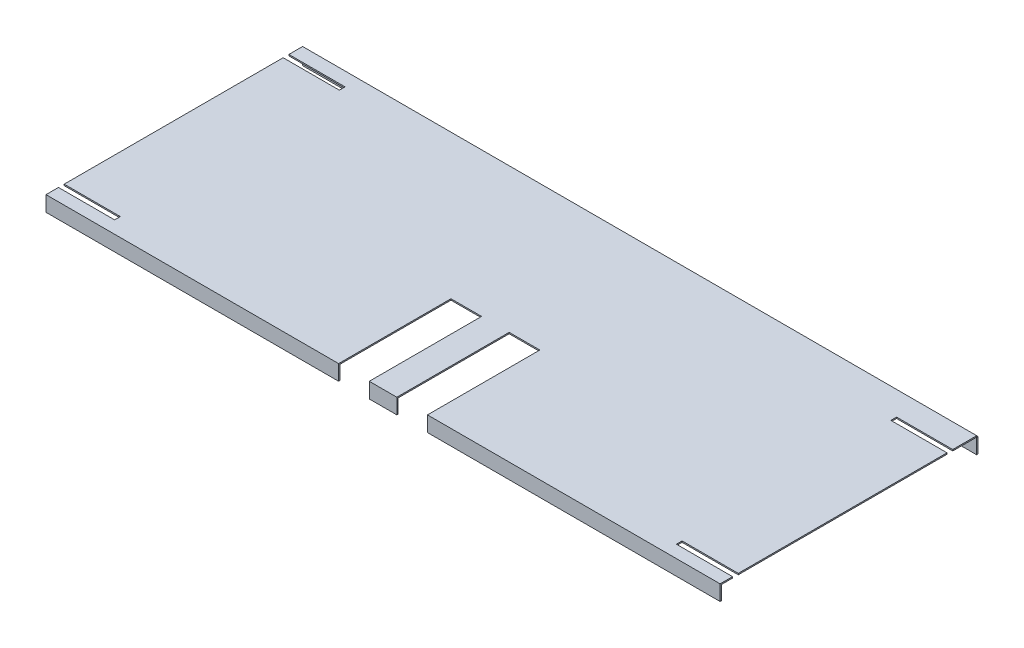
ISO-10303-21;
HEADER;
FILE_DESCRIPTION(('STEP AP214'),'2;1');
FILE_NAME('part.step','',(''),(''),'','','');
FILE_SCHEMA(('AUTOMOTIVE_DESIGN { 1 0 10303 214 1 1 1 1 }'));
ENDSEC;
DATA;
#1=APPLICATION_CONTEXT('core data for automotive mechanical design processes');
#2=APPLICATION_PROTOCOL_DEFINITION('international standard','automotive_design',2000,#1);
#3=PRODUCT_CONTEXT('',#1,'mechanical');
#4=PRODUCT('Part','Part','',(#3));
#5=PRODUCT_RELATED_PRODUCT_CATEGORY('part','',(#4));
#6=PRODUCT_DEFINITION_FORMATION('','',#4);
#7=PRODUCT_DEFINITION_CONTEXT('part definition',#1,'design');
#8=PRODUCT_DEFINITION('design','',#6,#7);
#9=PRODUCT_DEFINITION_SHAPE('','',#8);
#10=(LENGTH_UNIT() NAMED_UNIT(*) SI_UNIT(.MILLI.,.METRE.));
#11=(NAMED_UNIT(*) PLANE_ANGLE_UNIT() SI_UNIT($,.RADIAN.));
#12=(NAMED_UNIT(*) SI_UNIT($,.STERADIAN.) SOLID_ANGLE_UNIT());
#13=UNCERTAINTY_MEASURE_WITH_UNIT(LENGTH_MEASURE(1.E-05),#10,'distance_accuracy_value','');
#14=(GEOMETRIC_REPRESENTATION_CONTEXT(3) GLOBAL_UNCERTAINTY_ASSIGNED_CONTEXT((#13)) GLOBAL_UNIT_ASSIGNED_CONTEXT((#10,
#11,#12)) REPRESENTATION_CONTEXT('',''));
#15=CARTESIAN_POINT('',(0.,0.,0.));
#16=DIRECTION('',(0.,0.,1.));
#17=DIRECTION('',(1.,0.,0.));
#18=AXIS2_PLACEMENT_3D('',#15,#16,#17);
#19=CARTESIAN_POINT('',(0.,0.,-1.6002));
#20=DIRECTION('',(1.,0.,0.));
#21=DIRECTION('',(0.,1.,0.));
#22=AXIS2_PLACEMENT_3D('',#19,#20,#21);
#23=PLANE('',#22);
#24=DIRECTION('',(0.,1.,0.));
#25=VECTOR('',#24,1.);
#26=CARTESIAN_POINT('',(0.,0.,0.));
#27=LINE('',#26,#25);
#28=CARTESIAN_POINT('',(0.,-19.05,0.));
#29=VERTEX_POINT('',#28);
#30=CARTESIAN_POINT('',(0.,0.,0.));
#31=VERTEX_POINT('',#30);
#32=EDGE_CURVE('E109',#29,#31,#27,.T.);
#33=ORIENTED_EDGE('',*,*,#32,.T.);
#34=DIRECTION('',(0.,0.,1.));
#35=VECTOR('',#34,1.);
#36=CARTESIAN_POINT('',(0.,0.,-1.6002));
#37=LINE('',#36,#35);
#38=CARTESIAN_POINT('',(0.,0.,-1.6002));
#39=VERTEX_POINT('',#38);
#40=EDGE_CURVE('E12',#39,#31,#37,.T.);
#41=ORIENTED_EDGE('',*,*,#40,.F.);
#42=DIRECTION('',(0.,1.,0.));
#43=VECTOR('',#42,1.);
#44=CARTESIAN_POINT('',(0.,0.,-1.6002));
#45=LINE('',#44,#43);
#46=CARTESIAN_POINT('',(0.,-19.05,-1.6002));
#47=VERTEX_POINT('',#46);
#48=EDGE_CURVE('E97',#47,#39,#45,.T.);
#49=ORIENTED_EDGE('',*,*,#48,.F.);
#50=DIRECTION('',(0.,0.,1.));
#51=VECTOR('',#50,1.);
#52=CARTESIAN_POINT('',(0.,-19.05,-1.6002));
#53=LINE('',#52,#51);
#54=EDGE_CURVE('E105',#47,#29,#53,.T.);
#55=ORIENTED_EDGE('',*,*,#54,.T.);
#56=EDGE_LOOP('',(#33,#41,#49,#55));
#57=FACE_BOUND('',#56,.T.);
#58=ADVANCED_FACE('F46',(#57),#23,.F.);
#59=CARTESIAN_POINT('',(0.,0.,-1.6002));
#60=DIRECTION('',(0.,-1.,0.));
#61=DIRECTION('',(0.,0.,-1.));
#62=AXIS2_PLACEMENT_3D('',#59,#60,#61);
#63=PLANE('',#62);
#64=DIRECTION('',(1.,0.,0.));
#65=VECTOR('',#64,1.);
#66=CARTESIAN_POINT('',(0.,0.,0.));
#67=LINE('',#66,#65);
#68=CARTESIAN_POINT('',(838.2,0.,0.));
#69=VERTEX_POINT('',#68);
#70=EDGE_CURVE('E101',#31,#69,#67,.T.);
#71=ORIENTED_EDGE('',*,*,#70,.T.);
#72=DIRECTION('',(0.,0.,1.));
#73=VECTOR('',#72,1.);
#74=CARTESIAN_POINT('',(838.2,0.,-1.6002));
#75=LINE('',#74,#73);
#76=CARTESIAN_POINT('',(838.2,0.,-1.6002));
#77=VERTEX_POINT('',#76);
#78=EDGE_CURVE('E54',#77,#69,#75,.T.);
#79=ORIENTED_EDGE('',*,*,#78,.F.);
#80=DIRECTION('',(1.,0.,0.));
#81=VECTOR('',#80,1.);
#82=CARTESIAN_POINT('',(0.,0.,-1.6002));
#83=LINE('',#82,#81);
#84=EDGE_CURVE('E92',#39,#77,#83,.T.);
#85=ORIENTED_EDGE('',*,*,#84,.F.);
#86=ORIENTED_EDGE('',*,*,#40,.T.);
#87=EDGE_LOOP('',(#71,#79,#85,#86));
#88=FACE_BOUND('',#87,.T.);
#89=ADVANCED_FACE('F100',(#88),#63,.F.);
#90=CARTESIAN_POINT('',(838.2,0.,-1.6002));
#91=DIRECTION('',(-1.,0.,0.));
#92=DIRECTION('',(0.,0.,1.));
#93=AXIS2_PLACEMENT_3D('',#90,#91,#92);
#94=PLANE('',#93);
#95=DIRECTION('',(0.,-1.,0.));
#96=VECTOR('',#95,1.);
#97=CARTESIAN_POINT('',(838.2,0.,0.));
#98=LINE('',#97,#96);
#99=CARTESIAN_POINT('',(838.2,-19.0500000000001,0.));
#100=VERTEX_POINT('',#99);
#101=EDGE_CURVE('E79',#69,#100,#98,.T.);
#102=ORIENTED_EDGE('',*,*,#101,.T.);
#103=DIRECTION('',(0.,0.,1.));
#104=VECTOR('',#103,1.);
#105=CARTESIAN_POINT('',(838.2,-19.0500000000001,-1.6002));
#106=LINE('',#105,#104);
#107=CARTESIAN_POINT('',(838.2,-19.0500000000001,-1.6002));
#108=VERTEX_POINT('',#107);
#109=EDGE_CURVE('E102',#108,#100,#106,.T.);
#110=ORIENTED_EDGE('',*,*,#109,.F.);
#111=DIRECTION('',(0.,-1.,0.));
#112=VECTOR('',#111,1.);
#113=CARTESIAN_POINT('',(838.2,0.,-1.6002));
#114=LINE('',#113,#112);
#115=EDGE_CURVE('E95',#77,#108,#114,.T.);
#116=ORIENTED_EDGE('',*,*,#115,.F.);
#117=ORIENTED_EDGE('',*,*,#78,.T.);
#118=EDGE_LOOP('',(#102,#110,#116,#117));
#119=FACE_BOUND('',#118,.T.);
#120=ADVANCED_FACE('F103',(#119),#94,.F.);
#121=CARTESIAN_POINT('',(0.,-19.05,-1.6002));
#122=DIRECTION('',(0.,1.,0.));
#123=DIRECTION('',(-1.,0.,0.));
#124=AXIS2_PLACEMENT_3D('',#121,#122,#123);
#125=PLANE('',#124);
#126=DIRECTION('',(-1.,0.,0.));
#127=VECTOR('',#126,1.);
#128=CARTESIAN_POINT('',(0.,-19.05,0.));
#129=LINE('',#128,#127);
#130=EDGE_CURVE('E85',#100,#29,#129,.T.);
#131=ORIENTED_EDGE('',*,*,#130,.T.);
#132=ORIENTED_EDGE('',*,*,#54,.F.);
#133=DIRECTION('',(-1.,0.,0.));
#134=VECTOR('',#133,1.);
#135=CARTESIAN_POINT('',(0.,-19.05,-1.6002));
#136=LINE('',#135,#134);
#137=EDGE_CURVE('E62',#108,#47,#136,.T.);
#138=ORIENTED_EDGE('',*,*,#137,.F.);
#139=ORIENTED_EDGE('',*,*,#109,.T.);
#140=EDGE_LOOP('',(#131,#132,#138,#139));
#141=FACE_BOUND('',#140,.T.);
#142=ADVANCED_FACE('F116',(#141),#125,.F.);
#143=CARTESIAN_POINT('',(0.,0.,-1.6002));
#144=DIRECTION('',(0.,0.,1.));
#145=DIRECTION('',(1.,0.,0.));
#146=AXIS2_PLACEMENT_3D('',#143,#144,#145);
#147=PLANE('',#146);
#148=ORIENTED_EDGE('',*,*,#48,.T.);
#149=ORIENTED_EDGE('',*,*,#84,.T.);
#150=ORIENTED_EDGE('',*,*,#115,.T.);
#151=ORIENTED_EDGE('',*,*,#137,.T.);
#152=EDGE_LOOP('',(#148,#149,#150,#151));
#153=FACE_BOUND('',#152,.T.);
#154=ADVANCED_FACE('F93',(#153),#147,.F.);
#155=CARTESIAN_POINT('',(0.,0.,0.));
#156=DIRECTION('',(0.,0.,1.));
#157=DIRECTION('',(1.,0.,0.));
#158=AXIS2_PLACEMENT_3D('',#155,#156,#157);
#159=PLANE('',#158);
#160=ORIENTED_EDGE('',*,*,#32,.F.);
#161=ORIENTED_EDGE('',*,*,#130,.F.);
#162=ORIENTED_EDGE('',*,*,#101,.F.);
#163=ORIENTED_EDGE('',*,*,#70,.F.);
#164=EDGE_LOOP('',(#160,#161,#162,#163));
#165=FACE_BOUND('',#164,.T.);
#166=ADVANCED_FACE('F119',(#165),#159,.T.);
#167=CLOSED_SHELL('',(#58,#89,#120,#142,#154,#166));
#168=MANIFOLD_SOLID_BREP('B2',#167);
#169=CARTESIAN_POINT('',(838.2,1.6002,0.));
#170=DIRECTION('',(-1.,0.,0.));
#171=DIRECTION('',(0.,0.,1.));
#172=AXIS2_PLACEMENT_3D('',#169,#170,#171);
#173=PLANE('',#172);
#174=DIRECTION('',(0.,0.,-1.));
#175=VECTOR('',#174,1.);
#176=CARTESIAN_POINT('',(838.2,0.,0.));
#177=LINE('',#176,#175);
#178=CARTESIAN_POINT('',(838.2,0.,317.5));
#179=VERTEX_POINT('',#178);
#180=CARTESIAN_POINT('',(838.2,0.,303.6062));
#181=VERTEX_POINT('',#180);
#182=EDGE_CURVE('E415',#179,#181,#177,.T.);
#183=ORIENTED_EDGE('',*,*,#182,.T.);
#184=DIRECTION('',(0.,1.,0.));
#185=VECTOR('',#184,1.);
#186=CARTESIAN_POINT('',(838.2,-19.0510000000001,303.6062));
#187=LINE('',#186,#185);
#188=CARTESIAN_POINT('',(838.2,1.6002,303.6062));
#189=VERTEX_POINT('',#188);
#190=EDGE_CURVE('E401',#181,#189,#187,.T.);
#191=ORIENTED_EDGE('',*,*,#190,.T.);
#192=DIRECTION('',(0.,0.,-1.));
#193=VECTOR('',#192,1.);
#194=CARTESIAN_POINT('',(838.2,1.6002,0.));
#195=LINE('',#194,#193);
#196=CARTESIAN_POINT('',(838.2,1.6002,319.1002));
#197=VERTEX_POINT('',#196);
#198=EDGE_CURVE('E517',#197,#189,#195,.T.);
#199=ORIENTED_EDGE('',*,*,#198,.F.);
#200=DIRECTION('',(0.,1.,0.));
#201=VECTOR('',#200,1.);
#202=CARTESIAN_POINT('',(838.2,1.6002,319.1002));
#203=LINE('',#202,#201);
#204=CARTESIAN_POINT('',(838.2,-17.4498,319.1002));
#205=VERTEX_POINT('',#204);
#206=EDGE_CURVE('E506',#205,#197,#203,.T.);
#207=ORIENTED_EDGE('',*,*,#206,.F.);
#208=DIRECTION('',(0.,0.,-1.));
#209=VECTOR('',#208,1.);
#210=CARTESIAN_POINT('',(838.2,-17.4498,319.1002));
#211=LINE('',#210,#209);
#212=CARTESIAN_POINT('',(838.2,-17.4498,317.5));
#213=VERTEX_POINT('',#212);
#214=EDGE_CURVE('E464',#205,#213,#211,.T.);
#215=ORIENTED_EDGE('',*,*,#214,.T.);
#216=DIRECTION('',(0.,1.,0.));
#217=VECTOR('',#216,1.);
#218=CARTESIAN_POINT('',(838.2,1.6002,317.5));
#219=LINE('',#218,#217);
#220=EDGE_CURVE('E479',#213,#179,#219,.T.);
#221=ORIENTED_EDGE('',*,*,#220,.T.);
#222=EDGE_LOOP('',(#183,#191,#199,#207,#215,#221));
#223=FACE_BOUND('',#222,.T.);
#224=ADVANCED_FACE('F169',(#223),#173,.F.);
#225=CARTESIAN_POINT('',(838.2,1.6002,296.4942));
#226=VERTEX_POINT('',#225);
#227=CARTESIAN_POINT('',(838.2,1.6002,36.9062));
#228=VERTEX_POINT('',#227);
#229=EDGE_CURVE('E408',#226,#228,#195,.T.);
#230=ORIENTED_EDGE('',*,*,#229,.F.);
#231=DIRECTION('',(0.,1.,0.));
#232=VECTOR('',#231,1.);
#233=CARTESIAN_POINT('',(838.2,-19.0510000000001,296.4942));
#234=LINE('',#233,#232);
#235=CARTESIAN_POINT('',(838.2,0.,296.4942));
#236=VERTEX_POINT('',#235);
#237=EDGE_CURVE('E396',#236,#226,#234,.T.);
#238=ORIENTED_EDGE('',*,*,#237,.F.);
#239=CARTESIAN_POINT('',(838.2,0.,36.9062));
#240=VERTEX_POINT('',#239);
#241=EDGE_CURVE('E173',#236,#240,#177,.T.);
#242=ORIENTED_EDGE('',*,*,#241,.T.);
#243=DIRECTION('',(0.,1.,0.));
#244=VECTOR('',#243,1.);
#245=CARTESIAN_POINT('',(838.2,-19.0510000000001,36.9062));
#246=LINE('',#245,#244);
#247=EDGE_CURVE('E732',#240,#228,#246,.T.);
#248=ORIENTED_EDGE('',*,*,#247,.T.);
#249=EDGE_LOOP('',(#230,#238,#242,#248));
#250=FACE_BOUND('',#249,.T.);
#251=ADVANCED_FACE('F405',(#250),#173,.F.);
#252=CARTESIAN_POINT('',(0.,1.6002,0.));
#253=DIRECTION('',(1.,0.,0.));
#254=DIRECTION('',(0.,0.,-1.));
#255=AXIS2_PLACEMENT_3D('',#252,#253,#254);
#256=PLANE('',#255);
#257=DIRECTION('',(0.,0.,1.));
#258=VECTOR('',#257,1.);
#259=CARTESIAN_POINT('',(0.,0.,0.));
#260=LINE('',#259,#258);
#261=CARTESIAN_POINT('',(0.,0.,24.2062));
#262=VERTEX_POINT('',#261);
#263=CARTESIAN_POINT('',(0.,0.,296.4942));
#264=VERTEX_POINT('',#263);
#265=EDGE_CURVE('E451',#262,#264,#260,.T.);
#266=ORIENTED_EDGE('',*,*,#265,.T.);
#267=DIRECTION('',(0.,1.,0.));
#268=VECTOR('',#267,1.);
#269=CARTESIAN_POINT('',(0.,-19.0510000000001,296.4942));
#270=LINE('',#269,#268);
#271=CARTESIAN_POINT('',(0.,1.6002,296.4942));
#272=VERTEX_POINT('',#271);
#273=EDGE_CURVE('E751',#264,#272,#270,.T.);
#274=ORIENTED_EDGE('',*,*,#273,.T.);
#275=DIRECTION('',(0.,0.,1.));
#276=VECTOR('',#275,1.);
#277=CARTESIAN_POINT('',(0.,1.6002,0.));
#278=LINE('',#277,#276);
#279=CARTESIAN_POINT('',(0.,1.6002,24.2062));
#280=VERTEX_POINT('',#279);
#281=EDGE_CURVE('E533',#280,#272,#278,.T.);
#282=ORIENTED_EDGE('',*,*,#281,.F.);
#283=DIRECTION('',(0.,1.,0.));
#284=VECTOR('',#283,1.);
#285=CARTESIAN_POINT('',(0.,-19.0510000000001,24.2062));
#286=LINE('',#285,#284);
#287=EDGE_CURVE('E572',#262,#280,#286,.T.);
#288=ORIENTED_EDGE('',*,*,#287,.F.);
#289=EDGE_LOOP('',(#266,#274,#282,#288));
#290=FACE_BOUND('',#289,.T.);
#291=ADVANCED_FACE('F716',(#290),#256,.F.);
#292=CARTESIAN_POINT('',(0.,0.,0.));
#293=VERTEX_POINT('',#292);
#294=CARTESIAN_POINT('',(0.,0.,17.0942));
#295=VERTEX_POINT('',#294);
#296=EDGE_CURVE('E437',#293,#295,#260,.T.);
#297=ORIENTED_EDGE('',*,*,#296,.T.);
#298=DIRECTION('',(0.,1.,0.));
#299=VECTOR('',#298,1.);
#300=CARTESIAN_POINT('',(0.,-19.0510000000001,17.0942));
#301=LINE('',#300,#299);
#302=CARTESIAN_POINT('',(0.,1.6002,17.0942));
#303=VERTEX_POINT('',#302);
#304=EDGE_CURVE('E573',#295,#303,#301,.T.);
#305=ORIENTED_EDGE('',*,*,#304,.T.);
#306=CARTESIAN_POINT('',(0.,1.6002,0.));
#307=VERTEX_POINT('',#306);
#308=EDGE_CURVE('E529',#307,#303,#278,.T.);
#309=ORIENTED_EDGE('',*,*,#308,.F.);
#310=DIRECTION('',(0.,-1.,0.));
#311=VECTOR('',#310,1.);
#312=CARTESIAN_POINT('',(0.,1.6002,0.));
#313=LINE('',#312,#311);
#314=EDGE_CURVE('E179',#307,#293,#313,.T.);
#315=ORIENTED_EDGE('',*,*,#314,.T.);
#316=EDGE_LOOP('',(#297,#305,#309,#315));
#317=FACE_BOUND('',#316,.T.);
#318=ADVANCED_FACE('F550',(#317),#256,.F.);
#319=CARTESIAN_POINT('',(0.,0.,317.5));
#320=DIRECTION('',(0.,0.,1.));
#321=DIRECTION('',(1.,0.,0.));
#322=AXIS2_PLACEMENT_3D('',#319,#320,#321);
#323=PLANE('',#322);
#324=DIRECTION('',(1.,0.,0.));
#325=VECTOR('',#324,1.);
#326=CARTESIAN_POINT('',(0.,0.,317.5));
#327=LINE('',#326,#325);
#328=CARTESIAN_POINT('',(401.955,0.,317.5));
#329=VERTEX_POINT('',#328);
#330=CARTESIAN_POINT('',(436.245,0.,317.5));
#331=VERTEX_POINT('',#330);
#332=EDGE_CURVE('E426',#329,#331,#327,.T.);
#333=ORIENTED_EDGE('',*,*,#332,.T.);
#334=DIRECTION('',(0.,1.,0.));
#335=VECTOR('',#334,1.);
#336=CARTESIAN_POINT('',(436.245,-17.450825,317.5));
#337=LINE('',#336,#335);
#338=CARTESIAN_POINT('',(436.245,-17.4498,317.5));
#339=VERTEX_POINT('',#338);
#340=EDGE_CURVE('E584',#339,#331,#337,.T.);
#341=ORIENTED_EDGE('',*,*,#340,.F.);
#342=DIRECTION('',(1.,0.,0.));
#343=VECTOR('',#342,1.);
#344=CARTESIAN_POINT('',(0.,-17.4498,317.5));
#345=LINE('',#344,#343);
#346=CARTESIAN_POINT('',(401.955,-17.4498,317.5));
#347=VERTEX_POINT('',#346);
#348=EDGE_CURVE('E486',#347,#339,#345,.T.);
#349=ORIENTED_EDGE('',*,*,#348,.F.);
#350=DIRECTION('',(0.,-1.,0.));
#351=VECTOR('',#350,1.);
#352=CARTESIAN_POINT('',(401.955,-17.450825,317.5));
#353=LINE('',#352,#351);
#354=EDGE_CURVE('E643',#329,#347,#353,.T.);
#355=ORIENTED_EDGE('',*,*,#354,.F.);
#356=EDGE_LOOP('',(#333,#341,#349,#355));
#357=FACE_BOUND('',#356,.T.);
#358=ADVANCED_FACE('F676',(#357),#323,.F.);
#359=CARTESIAN_POINT('',(0.,-17.4498,319.1002));
#360=DIRECTION('',(0.,1.,0.));
#361=DIRECTION('',(0.,0.,1.));
#362=AXIS2_PLACEMENT_3D('',#359,#360,#361);
#363=PLANE('',#362);
#364=ORIENTED_EDGE('',*,*,#348,.T.);
#365=DIRECTION('',(0.,0.,-1.));
#366=VECTOR('',#365,1.);
#367=CARTESIAN_POINT('',(436.245,-17.4498,179.4002));
#368=LINE('',#367,#366);
#369=CARTESIAN_POINT('',(436.245,-17.4498,319.1002));
#370=VERTEX_POINT('',#369);
#371=EDGE_CURVE('E582',#370,#339,#368,.T.);
#372=ORIENTED_EDGE('',*,*,#371,.F.);
#373=DIRECTION('',(1.,0.,0.));
#374=VECTOR('',#373,1.);
#375=CARTESIAN_POINT('',(0.,-17.4498,319.1002));
#376=LINE('',#375,#374);
#377=CARTESIAN_POINT('',(401.955,-17.4498,319.1002));
#378=VERTEX_POINT('',#377);
#379=EDGE_CURVE('E651',#378,#370,#376,.T.);
#380=ORIENTED_EDGE('',*,*,#379,.F.);
#381=DIRECTION('',(0.,0.,1.));
#382=VECTOR('',#381,1.);
#383=CARTESIAN_POINT('',(401.955,-17.4498,319.1002));
#384=LINE('',#383,#382);
#385=EDGE_CURVE('E635',#347,#378,#384,.T.);
#386=ORIENTED_EDGE('',*,*,#385,.F.);
#387=EDGE_LOOP('',(#364,#372,#380,#386));
#388=FACE_BOUND('',#387,.T.);
#389=ADVANCED_FACE('F669',(#388),#363,.F.);
#390=CARTESIAN_POINT('',(0.,0.,319.1002));
#391=DIRECTION('',(0.,0.,1.));
#392=DIRECTION('',(1.,0.,0.));
#393=AXIS2_PLACEMENT_3D('',#390,#391,#392);
#394=PLANE('',#393);
#395=DIRECTION('',(0.,1.,0.));
#396=VECTOR('',#395,1.);
#397=CARTESIAN_POINT('',(436.245,-17.450825,319.1002));
#398=LINE('',#397,#396);
#399=CARTESIAN_POINT('',(436.245,1.6002,319.1002));
#400=VERTEX_POINT('',#399);
#401=EDGE_CURVE('E601',#370,#400,#398,.T.);
#402=ORIENTED_EDGE('',*,*,#401,.T.);
#403=DIRECTION('',(-1.,0.,0.));
#404=VECTOR('',#403,1.);
#405=CARTESIAN_POINT('',(0.,1.6002,319.1002));
#406=LINE('',#405,#404);
#407=CARTESIAN_POINT('',(401.955,1.6002,319.1002));
#408=VERTEX_POINT('',#407);
#409=EDGE_CURVE('E654',#400,#408,#406,.T.);
#410=ORIENTED_EDGE('',*,*,#409,.T.);
#411=DIRECTION('',(0.,1.,0.));
#412=VECTOR('',#411,1.);
#413=CARTESIAN_POINT('',(401.955,-17.450825,319.1002));
#414=LINE('',#413,#412);
#415=EDGE_CURVE('E631',#378,#408,#414,.T.);
#416=ORIENTED_EDGE('',*,*,#415,.F.);
#417=ORIENTED_EDGE('',*,*,#379,.T.);
#418=EDGE_LOOP('',(#402,#410,#416,#417));
#419=FACE_BOUND('',#418,.T.);
#420=ADVANCED_FACE('F664',(#419),#394,.T.);
#421=CARTESIAN_POINT('',(0.,0.,317.5));
#422=VERTEX_POINT('',#421);
#423=CARTESIAN_POINT('',(363.855,0.,317.5));
#424=VERTEX_POINT('',#423);
#425=EDGE_CURVE('E420',#422,#424,#327,.T.);
#426=ORIENTED_EDGE('',*,*,#425,.T.);
#427=DIRECTION('',(0.,1.,0.));
#428=VECTOR('',#427,1.);
#429=CARTESIAN_POINT('',(363.855,-17.450825,317.5));
#430=LINE('',#429,#428);
#431=CARTESIAN_POINT('',(363.855,-17.4498,317.5));
#432=VERTEX_POINT('',#431);
#433=EDGE_CURVE('E615',#432,#424,#430,.T.);
#434=ORIENTED_EDGE('',*,*,#433,.F.);
#435=CARTESIAN_POINT('',(0.,-17.4498,317.5));
#436=VERTEX_POINT('',#435);
#437=EDGE_CURVE('E485',#436,#432,#345,.T.);
#438=ORIENTED_EDGE('',*,*,#437,.F.);
#439=DIRECTION('',(0.,-1.,0.));
#440=VECTOR('',#439,1.);
#441=CARTESIAN_POINT('',(0.,1.6002,317.5));
#442=LINE('',#441,#440);
#443=EDGE_CURVE('E474',#422,#436,#442,.T.);
#444=ORIENTED_EDGE('',*,*,#443,.F.);
#445=EDGE_LOOP('',(#426,#434,#438,#444));
#446=FACE_BOUND('',#445,.T.);
#447=ADVANCED_FACE('F697',(#446),#323,.F.);
#448=ORIENTED_EDGE('',*,*,#437,.T.);
#449=DIRECTION('',(0.,0.,-1.));
#450=VECTOR('',#449,1.);
#451=CARTESIAN_POINT('',(363.855,-17.4498,179.4002));
#452=LINE('',#451,#450);
#453=CARTESIAN_POINT('',(363.855,-17.4498,319.1002));
#454=VERTEX_POINT('',#453);
#455=EDGE_CURVE('E613',#454,#432,#452,.T.);
#456=ORIENTED_EDGE('',*,*,#455,.F.);
#457=CARTESIAN_POINT('',(0.,-17.4498,319.1002));
#458=VERTEX_POINT('',#457);
#459=EDGE_CURVE('E649',#458,#454,#376,.T.);
#460=ORIENTED_EDGE('',*,*,#459,.F.);
#461=DIRECTION('',(0.,0.,-1.));
#462=VECTOR('',#461,1.);
#463=CARTESIAN_POINT('',(0.,-17.4498,319.1002));
#464=LINE('',#463,#462);
#465=EDGE_CURVE('E458',#458,#436,#464,.T.);
#466=ORIENTED_EDGE('',*,*,#465,.T.);
#467=EDGE_LOOP('',(#448,#456,#460,#466));
#468=FACE_BOUND('',#467,.T.);
#469=ADVANCED_FACE('F699',(#468),#363,.F.);
#470=DIRECTION('',(0.,1.,0.));
#471=VECTOR('',#470,1.);
#472=CARTESIAN_POINT('',(363.855,-17.450825,319.1002));
#473=LINE('',#472,#471);
#474=CARTESIAN_POINT('',(363.855,1.6002,319.1002));
#475=VERTEX_POINT('',#474);
#476=EDGE_CURVE('E632',#454,#475,#473,.T.);
#477=ORIENTED_EDGE('',*,*,#476,.T.);
#478=CARTESIAN_POINT('',(0.,1.6002,319.1002));
#479=VERTEX_POINT('',#478);
#480=EDGE_CURVE('E652',#475,#479,#406,.T.);
#481=ORIENTED_EDGE('',*,*,#480,.T.);
#482=DIRECTION('',(0.,-1.,0.));
#483=VECTOR('',#482,1.);
#484=CARTESIAN_POINT('',(0.,1.6002,319.1002));
#485=LINE('',#484,#483);
#486=EDGE_CURVE('E491',#479,#458,#485,.T.);
#487=ORIENTED_EDGE('',*,*,#486,.T.);
#488=ORIENTED_EDGE('',*,*,#459,.T.);
#489=EDGE_LOOP('',(#477,#481,#487,#488));
#490=FACE_BOUND('',#489,.T.);
#491=ADVANCED_FACE('F698',(#490),#394,.T.);
#492=CARTESIAN_POINT('',(0.,1.6002,303.6062));
#493=VERTEX_POINT('',#492);
#494=EDGE_CURVE('E534',#493,#479,#278,.T.);
#495=ORIENTED_EDGE('',*,*,#494,.F.);
#496=DIRECTION('',(0.,1.,0.));
#497=VECTOR('',#496,1.);
#498=CARTESIAN_POINT('',(0.,-19.0510000000001,303.6062));
#499=LINE('',#498,#497);
#500=CARTESIAN_POINT('',(0.,0.,303.6062));
#501=VERTEX_POINT('',#500);
#502=EDGE_CURVE('E750',#501,#493,#499,.T.);
#503=ORIENTED_EDGE('',*,*,#502,.F.);
#504=EDGE_CURVE('E429',#501,#422,#260,.T.);
#505=ORIENTED_EDGE('',*,*,#504,.T.);
#506=ORIENTED_EDGE('',*,*,#443,.T.);
#507=ORIENTED_EDGE('',*,*,#465,.F.);
#508=ORIENTED_EDGE('',*,*,#486,.F.);
#509=EDGE_LOOP('',(#495,#503,#505,#506,#507,#508));
#510=FACE_BOUND('',#509,.T.);
#511=ADVANCED_FACE('F171',(#510),#256,.F.);
#512=CARTESIAN_POINT('',(838.2,1.6002,29.7942));
#513=VERTEX_POINT('',#512);
#514=CARTESIAN_POINT('',(838.2,1.6002,0.));
#515=VERTEX_POINT('',#514);
#516=EDGE_CURVE('E528',#513,#515,#195,.T.);
#517=ORIENTED_EDGE('',*,*,#516,.F.);
#518=DIRECTION('',(0.,1.,0.));
#519=VECTOR('',#518,1.);
#520=CARTESIAN_POINT('',(838.2,-19.0510000000001,29.7942));
#521=LINE('',#520,#519);
#522=CARTESIAN_POINT('',(838.2,0.,29.7942));
#523=VERTEX_POINT('',#522);
#524=EDGE_CURVE('E723',#523,#513,#521,.T.);
#525=ORIENTED_EDGE('',*,*,#524,.F.);
#526=CARTESIAN_POINT('',(838.2,0.,0.));
#527=VERTEX_POINT('',#526);
#528=EDGE_CURVE('E416',#523,#527,#177,.T.);
#529=ORIENTED_EDGE('',*,*,#528,.T.);
#530=DIRECTION('',(0.,-1.,0.));
#531=VECTOR('',#530,1.);
#532=CARTESIAN_POINT('',(838.2,1.6002,0.));
#533=LINE('',#532,#531);
#534=EDGE_CURVE('E44',#515,#527,#533,.T.);
#535=ORIENTED_EDGE('',*,*,#534,.F.);
#536=EDGE_LOOP('',(#517,#525,#529,#535));
#537=FACE_BOUND('',#536,.T.);
#538=ADVANCED_FACE('F712',(#537),#173,.F.);
#539=CARTESIAN_POINT('',(0.,1.6002,0.));
#540=DIRECTION('',(0.,0.,1.));
#541=DIRECTION('',(1.,0.,0.));
#542=AXIS2_PLACEMENT_3D('',#539,#540,#541);
#543=PLANE('',#542);
#544=DIRECTION('',(-1.,0.,0.));
#545=VECTOR('',#544,1.);
#546=CARTESIAN_POINT('',(0.,0.,0.));
#547=LINE('',#546,#545);
#548=EDGE_CURVE('E418',#527,#293,#547,.T.);
#549=ORIENTED_EDGE('',*,*,#548,.T.);
#550=ORIENTED_EDGE('',*,*,#314,.F.);
#551=DIRECTION('',(-1.,0.,0.));
#552=VECTOR('',#551,1.);
#553=CARTESIAN_POINT('',(0.,1.6002,0.));
#554=LINE('',#553,#552);
#555=EDGE_CURVE('E441',#515,#307,#554,.T.);
#556=ORIENTED_EDGE('',*,*,#555,.F.);
#557=ORIENTED_EDGE('',*,*,#534,.T.);
#558=EDGE_LOOP('',(#549,#550,#556,#557));
#559=FACE_BOUND('',#558,.T.);
#560=ADVANCED_FACE('F546',(#559),#543,.F.);
#561=CARTESIAN_POINT('',(0.,1.6002,0.));
#562=DIRECTION('',(0.,1.,0.));
#563=DIRECTION('',(0.,0.,1.));
#564=AXIS2_PLACEMENT_3D('',#561,#562,#563);
#565=PLANE('',#564);
#566=DIRECTION('',(1.,0.,0.));
#567=VECTOR('',#566,1.);
#568=CARTESIAN_POINT('',(838.2,1.6002,303.6062));
#569=LINE('',#568,#567);
#570=CARTESIAN_POINT('',(768.35,1.6002,303.6062));
#571=VERTEX_POINT('',#570);
#572=EDGE_CURVE('E409',#571,#189,#569,.T.);
#573=ORIENTED_EDGE('',*,*,#572,.F.);
#574=DIRECTION('',(0.,0.,1.));
#575=VECTOR('',#574,1.);
#576=CARTESIAN_POINT('',(768.35,1.6002,296.4942));
#577=LINE('',#576,#575);
#578=CARTESIAN_POINT('',(768.35,1.6002,296.4942));
#579=VERTEX_POINT('',#578);
#580=EDGE_CURVE('E966',#579,#571,#577,.T.);
#581=ORIENTED_EDGE('',*,*,#580,.F.);
#582=DIRECTION('',(-1.,0.,0.));
#583=VECTOR('',#582,1.);
#584=CARTESIAN_POINT('',(838.2,1.6002,296.4942));
#585=LINE('',#584,#583);
#586=EDGE_CURVE('E961',#226,#579,#585,.T.);
#587=ORIENTED_EDGE('',*,*,#586,.F.);
#588=ORIENTED_EDGE('',*,*,#229,.T.);
#589=DIRECTION('',(1.,0.,0.));
#590=VECTOR('',#589,1.);
#591=CARTESIAN_POINT('',(838.2,1.6002,36.9062));
#592=LINE('',#591,#590);
#593=CARTESIAN_POINT('',(768.35,1.6002,36.9062));
#594=VERTEX_POINT('',#593);
#595=EDGE_CURVE('E727',#594,#228,#592,.T.);
#596=ORIENTED_EDGE('',*,*,#595,.F.);
#597=DIRECTION('',(0.,0.,1.));
#598=VECTOR('',#597,1.);
#599=CARTESIAN_POINT('',(768.35,1.6002,29.7942));
#600=LINE('',#599,#598);
#601=CARTESIAN_POINT('',(768.35,1.6002,29.7942));
#602=VERTEX_POINT('',#601);
#603=EDGE_CURVE('E975',#602,#594,#600,.T.);
#604=ORIENTED_EDGE('',*,*,#603,.F.);
#605=DIRECTION('',(-1.,0.,0.));
#606=VECTOR('',#605,1.);
#607=CARTESIAN_POINT('',(838.2,1.6002,29.7942));
#608=LINE('',#607,#606);
#609=EDGE_CURVE('E973',#513,#602,#608,.T.);
#610=ORIENTED_EDGE('',*,*,#609,.F.);
#611=ORIENTED_EDGE('',*,*,#516,.T.);
#612=ORIENTED_EDGE('',*,*,#555,.T.);
#613=ORIENTED_EDGE('',*,*,#308,.T.);
#614=DIRECTION('',(-1.,0.,0.));
#615=VECTOR('',#614,1.);
#616=CARTESIAN_POINT('',(0.,1.6002,17.0942));
#617=LINE('',#616,#615);
#618=CARTESIAN_POINT('',(69.85,1.6002,17.0942));
#619=VERTEX_POINT('',#618);
#620=EDGE_CURVE('E570',#619,#303,#617,.T.);
#621=ORIENTED_EDGE('',*,*,#620,.F.);
#622=DIRECTION('',(0.,0.,-1.));
#623=VECTOR('',#622,1.);
#624=CARTESIAN_POINT('',(69.85,1.6002,17.0942));
#625=LINE('',#624,#623);
#626=CARTESIAN_POINT('',(69.85,1.6002,24.2062));
#627=VERTEX_POINT('',#626);
#628=EDGE_CURVE('E562',#627,#619,#625,.T.);
#629=ORIENTED_EDGE('',*,*,#628,.F.);
#630=DIRECTION('',(1.,0.,0.));
#631=VECTOR('',#630,1.);
#632=CARTESIAN_POINT('',(0.,1.6002,24.2062));
#633=LINE('',#632,#631);
#634=EDGE_CURVE('E559',#280,#627,#633,.T.);
#635=ORIENTED_EDGE('',*,*,#634,.F.);
#636=ORIENTED_EDGE('',*,*,#281,.T.);
#637=DIRECTION('',(-1.,0.,0.));
#638=VECTOR('',#637,1.);
#639=CARTESIAN_POINT('',(0.,1.6002,296.4942));
#640=LINE('',#639,#638);
#641=CARTESIAN_POINT('',(69.85,1.6002,296.4942));
#642=VERTEX_POINT('',#641);
#643=EDGE_CURVE('E748',#642,#272,#640,.T.);
#644=ORIENTED_EDGE('',*,*,#643,.F.);
#645=DIRECTION('',(0.,0.,-1.));
#646=VECTOR('',#645,1.);
#647=CARTESIAN_POINT('',(69.85,1.6002,296.4942));
#648=LINE('',#647,#646);
#649=CARTESIAN_POINT('',(69.85,1.6002,303.6062));
#650=VERTEX_POINT('',#649);
#651=EDGE_CURVE('E745',#650,#642,#648,.T.);
#652=ORIENTED_EDGE('',*,*,#651,.F.);
#653=DIRECTION('',(1.,0.,0.));
#654=VECTOR('',#653,1.);
#655=CARTESIAN_POINT('',(0.,1.6002,303.6062));
#656=LINE('',#655,#654);
#657=EDGE_CURVE('E742',#493,#650,#656,.T.);
#658=ORIENTED_EDGE('',*,*,#657,.F.);
#659=ORIENTED_EDGE('',*,*,#494,.T.);
#660=ORIENTED_EDGE('',*,*,#480,.F.);
#661=DIRECTION('',(0.,0.,1.));
#662=VECTOR('',#661,1.);
#663=CARTESIAN_POINT('',(363.855,1.6002,179.4002));
#664=LINE('',#663,#662);
#665=CARTESIAN_POINT('',(363.855,1.6002,179.4002));
#666=VERTEX_POINT('',#665);
#667=EDGE_CURVE('E629',#666,#475,#664,.T.);
#668=ORIENTED_EDGE('',*,*,#667,.F.);
#669=DIRECTION('',(-1.,0.,0.));
#670=VECTOR('',#669,1.);
#671=CARTESIAN_POINT('',(363.855,1.6002,179.4002));
#672=LINE('',#671,#670);
#673=CARTESIAN_POINT('',(401.955,1.6002,179.4002));
#674=VERTEX_POINT('',#673);
#675=EDGE_CURVE('E626',#674,#666,#672,.T.);
#676=ORIENTED_EDGE('',*,*,#675,.F.);
#677=DIRECTION('',(0.,0.,-1.));
#678=VECTOR('',#677,1.);
#679=CARTESIAN_POINT('',(401.955,1.6002,319.1002));
#680=LINE('',#679,#678);
#681=EDGE_CURVE('E623',#408,#674,#680,.T.);
#682=ORIENTED_EDGE('',*,*,#681,.F.);
#683=ORIENTED_EDGE('',*,*,#409,.F.);
#684=DIRECTION('',(0.,0.,1.));
#685=VECTOR('',#684,1.);
#686=CARTESIAN_POINT('',(436.245,1.6002,179.4002));
#687=LINE('',#686,#685);
#688=CARTESIAN_POINT('',(436.245,1.6002,179.4002));
#689=VERTEX_POINT('',#688);
#690=EDGE_CURVE('E598',#689,#400,#687,.T.);
#691=ORIENTED_EDGE('',*,*,#690,.F.);
#692=DIRECTION('',(-1.,0.,0.));
#693=VECTOR('',#692,1.);
#694=CARTESIAN_POINT('',(436.245,1.6002,179.4002));
#695=LINE('',#694,#693);
#696=CARTESIAN_POINT('',(474.345,1.6002,179.4002));
#697=VERTEX_POINT('',#696);
#698=EDGE_CURVE('E595',#697,#689,#695,.T.);
#699=ORIENTED_EDGE('',*,*,#698,.F.);
#700=DIRECTION('',(0.,0.,-1.));
#701=VECTOR('',#700,1.);
#702=CARTESIAN_POINT('',(474.345,1.6002,319.1002));
#703=LINE('',#702,#701);
#704=CARTESIAN_POINT('',(474.345,1.6002,319.1002));
#705=VERTEX_POINT('',#704);
#706=EDGE_CURVE('E592',#705,#697,#703,.T.);
#707=ORIENTED_EDGE('',*,*,#706,.F.);
#708=EDGE_CURVE('E470',#197,#705,#406,.T.);
#709=ORIENTED_EDGE('',*,*,#708,.F.);
#710=ORIENTED_EDGE('',*,*,#198,.T.);
#711=EDGE_LOOP('',(#573,#581,#587,#588,#596,#604,#610,#611,#612,#613,#621,#629,#635,#636,#644,
#652,#658,#659,#660,#668,#676,#682,#683,#691,#699,#707,#709,#710));
#712=FACE_BOUND('',#711,.T.);
#713=ADVANCED_FACE('F524',(#712),#565,.T.);
#714=CARTESIAN_POINT('',(0.,0.,0.));
#715=DIRECTION('',(0.,1.,0.));
#716=DIRECTION('',(0.,0.,1.));
#717=AXIS2_PLACEMENT_3D('',#714,#715,#716);
#718=PLANE('',#717);
#719=DIRECTION('',(0.,0.,-1.));
#720=VECTOR('',#719,1.);
#721=CARTESIAN_POINT('',(768.35,0.,296.4942));
#722=LINE('',#721,#720);
#723=CARTESIAN_POINT('',(768.35,0.,303.6062));
#724=VERTEX_POINT('',#723);
#725=CARTESIAN_POINT('',(768.35,0.,296.4942));
#726=VERTEX_POINT('',#725);
#727=EDGE_CURVE('E187',#724,#726,#722,.T.);
#728=ORIENTED_EDGE('',*,*,#727,.F.);
#729=DIRECTION('',(-1.,0.,0.));
#730=VECTOR('',#729,1.);
#731=CARTESIAN_POINT('',(838.2,0.,303.6062));
#732=LINE('',#731,#730);
#733=EDGE_CURVE('E514',#181,#724,#732,.T.);
#734=ORIENTED_EDGE('',*,*,#733,.F.);
#735=ORIENTED_EDGE('',*,*,#182,.F.);
#736=CARTESIAN_POINT('',(474.345,0.,317.5));
#737=VERTEX_POINT('',#736);
#738=EDGE_CURVE('E449',#737,#179,#327,.T.);
#739=ORIENTED_EDGE('',*,*,#738,.F.);
#740=DIRECTION('',(0.,0.,1.));
#741=VECTOR('',#740,1.);
#742=CARTESIAN_POINT('',(474.345,0.,319.1002));
#743=LINE('',#742,#741);
#744=CARTESIAN_POINT('',(474.345,0.,179.4002));
#745=VERTEX_POINT('',#744);
#746=EDGE_CURVE('E611',#745,#737,#743,.T.);
#747=ORIENTED_EDGE('',*,*,#746,.F.);
#748=DIRECTION('',(1.,0.,0.));
#749=VECTOR('',#748,1.);
#750=CARTESIAN_POINT('',(436.245,0.,179.4002));
#751=LINE('',#750,#749);
#752=CARTESIAN_POINT('',(436.245,0.,179.4002));
#753=VERTEX_POINT('',#752);
#754=EDGE_CURVE('E586',#753,#745,#751,.T.);
#755=ORIENTED_EDGE('',*,*,#754,.F.);
#756=DIRECTION('',(0.,0.,-1.));
#757=VECTOR('',#756,1.);
#758=CARTESIAN_POINT('',(436.245,0.,179.4002));
#759=LINE('',#758,#757);
#760=EDGE_CURVE('E589',#331,#753,#759,.T.);
#761=ORIENTED_EDGE('',*,*,#760,.F.);
#762=ORIENTED_EDGE('',*,*,#332,.F.);
#763=DIRECTION('',(0.,0.,1.));
#764=VECTOR('',#763,1.);
#765=CARTESIAN_POINT('',(401.955,0.,319.1002));
#766=LINE('',#765,#764);
#767=CARTESIAN_POINT('',(401.955,0.,179.4002));
#768=VERTEX_POINT('',#767);
#769=EDGE_CURVE('E478',#768,#329,#766,.T.);
#770=ORIENTED_EDGE('',*,*,#769,.F.);
#771=DIRECTION('',(1.,0.,0.));
#772=VECTOR('',#771,1.);
#773=CARTESIAN_POINT('',(363.855,0.,179.4002));
#774=LINE('',#773,#772);
#775=CARTESIAN_POINT('',(363.855,0.,179.4002));
#776=VERTEX_POINT('',#775);
#777=EDGE_CURVE('E617',#776,#768,#774,.T.);
#778=ORIENTED_EDGE('',*,*,#777,.F.);
#779=DIRECTION('',(0.,0.,-1.));
#780=VECTOR('',#779,1.);
#781=CARTESIAN_POINT('',(363.855,0.,179.4002));
#782=LINE('',#781,#780);
#783=EDGE_CURVE('E620',#424,#776,#782,.T.);
#784=ORIENTED_EDGE('',*,*,#783,.F.);
#785=ORIENTED_EDGE('',*,*,#425,.F.);
#786=ORIENTED_EDGE('',*,*,#504,.F.);
#787=DIRECTION('',(-1.,0.,0.));
#788=VECTOR('',#787,1.);
#789=CARTESIAN_POINT('',(0.,0.,303.6062));
#790=LINE('',#789,#788);
#791=CARTESIAN_POINT('',(69.85,0.,303.6062));
#792=VERTEX_POINT('',#791);
#793=EDGE_CURVE('E564',#792,#501,#790,.T.);
#794=ORIENTED_EDGE('',*,*,#793,.F.);
#795=DIRECTION('',(0.,0.,1.));
#796=VECTOR('',#795,1.);
#797=CARTESIAN_POINT('',(69.85,0.,296.4942));
#798=LINE('',#797,#796);
#799=CARTESIAN_POINT('',(69.85,0.,296.4942));
#800=VERTEX_POINT('',#799);
#801=EDGE_CURVE('E731',#800,#792,#798,.T.);
#802=ORIENTED_EDGE('',*,*,#801,.F.);
#803=DIRECTION('',(1.,0.,0.));
#804=VECTOR('',#803,1.);
#805=CARTESIAN_POINT('',(0.,0.,296.4942));
#806=LINE('',#805,#804);
#807=EDGE_CURVE('E734',#264,#800,#806,.T.);
#808=ORIENTED_EDGE('',*,*,#807,.F.);
#809=ORIENTED_EDGE('',*,*,#265,.F.);
#810=DIRECTION('',(-1.,0.,0.));
#811=VECTOR('',#810,1.);
#812=CARTESIAN_POINT('',(0.,0.,24.2062));
#813=LINE('',#812,#811);
#814=CARTESIAN_POINT('',(69.85,0.,24.2062));
#815=VERTEX_POINT('',#814);
#816=EDGE_CURVE('E575',#815,#262,#813,.T.);
#817=ORIENTED_EDGE('',*,*,#816,.F.);
#818=DIRECTION('',(0.,0.,1.));
#819=VECTOR('',#818,1.);
#820=CARTESIAN_POINT('',(69.85,0.,17.0942));
#821=LINE('',#820,#819);
#822=CARTESIAN_POINT('',(69.85,0.,17.0942));
#823=VERTEX_POINT('',#822);
#824=EDGE_CURVE('E557',#823,#815,#821,.T.);
#825=ORIENTED_EDGE('',*,*,#824,.F.);
#826=DIRECTION('',(1.,0.,0.));
#827=VECTOR('',#826,1.);
#828=CARTESIAN_POINT('',(0.,0.,17.0942));
#829=LINE('',#828,#827);
#830=EDGE_CURVE('E555',#295,#823,#829,.T.);
#831=ORIENTED_EDGE('',*,*,#830,.F.);
#832=ORIENTED_EDGE('',*,*,#296,.F.);
#833=ORIENTED_EDGE('',*,*,#548,.F.);
#834=ORIENTED_EDGE('',*,*,#528,.F.);
#835=DIRECTION('',(1.,0.,0.));
#836=VECTOR('',#835,1.);
#837=CARTESIAN_POINT('',(838.2,0.,29.7942));
#838=LINE('',#837,#836);
#839=CARTESIAN_POINT('',(768.35,0.,29.7942));
#840=VERTEX_POINT('',#839);
#841=EDGE_CURVE('E730',#840,#523,#838,.T.);
#842=ORIENTED_EDGE('',*,*,#841,.F.);
#843=DIRECTION('',(0.,0.,-1.));
#844=VECTOR('',#843,1.);
#845=CARTESIAN_POINT('',(768.35,0.,29.7942));
#846=LINE('',#845,#844);
#847=CARTESIAN_POINT('',(768.35,0.,36.9062));
#848=VERTEX_POINT('',#847);
#849=EDGE_CURVE('E195',#848,#840,#846,.T.);
#850=ORIENTED_EDGE('',*,*,#849,.F.);
#851=DIRECTION('',(-1.,0.,0.));
#852=VECTOR('',#851,1.);
#853=CARTESIAN_POINT('',(838.2,0.,36.9062));
#854=LINE('',#853,#852);
#855=EDGE_CURVE('E414',#240,#848,#854,.T.);
#856=ORIENTED_EDGE('',*,*,#855,.F.);
#857=ORIENTED_EDGE('',*,*,#241,.F.);
#858=DIRECTION('',(1.,0.,0.));
#859=VECTOR('',#858,1.);
#860=CARTESIAN_POINT('',(838.2,0.,296.4942));
#861=LINE('',#860,#859);
#862=EDGE_CURVE('E392',#726,#236,#861,.T.);
#863=ORIENTED_EDGE('',*,*,#862,.F.);
#864=EDGE_LOOP('',(#728,#734,#735,#739,#747,#755,#761,#762,#770,#778,#784,#785,#786,#794,#802,
#808,#809,#817,#825,#831,#832,#833,#834,#842,#850,#856,#857,#863));
#865=FACE_BOUND('',#864,.T.);
#866=ADVANCED_FACE('F412',(#865),#718,.F.);
#867=CARTESIAN_POINT('',(474.345,-17.4498,317.5));
#868=VERTEX_POINT('',#867);
#869=EDGE_CURVE('E477',#868,#213,#345,.T.);
#870=ORIENTED_EDGE('',*,*,#869,.F.);
#871=DIRECTION('',(0.,-1.,0.));
#872=VECTOR('',#871,1.);
#873=CARTESIAN_POINT('',(474.345,-17.450825,317.5));
#874=LINE('',#873,#872);
#875=EDGE_CURVE('E510',#737,#868,#874,.T.);
#876=ORIENTED_EDGE('',*,*,#875,.F.);
#877=ORIENTED_EDGE('',*,*,#738,.T.);
#878=ORIENTED_EDGE('',*,*,#220,.F.);
#879=EDGE_LOOP('',(#870,#876,#877,#878));
#880=FACE_BOUND('',#879,.T.);
#881=ADVANCED_FACE('F507',(#880),#323,.F.);
#882=CARTESIAN_POINT('',(474.345,-17.4498,319.1002));
#883=VERTEX_POINT('',#882);
#884=EDGE_CURVE('E648',#883,#205,#376,.T.);
#885=ORIENTED_EDGE('',*,*,#884,.F.);
#886=DIRECTION('',(0.,0.,1.));
#887=VECTOR('',#886,1.);
#888=CARTESIAN_POINT('',(474.345,-17.4498,319.1002));
#889=LINE('',#888,#887);
#890=EDGE_CURVE('E500',#868,#883,#889,.T.);
#891=ORIENTED_EDGE('',*,*,#890,.F.);
#892=ORIENTED_EDGE('',*,*,#869,.T.);
#893=ORIENTED_EDGE('',*,*,#214,.F.);
#894=EDGE_LOOP('',(#885,#891,#892,#893));
#895=FACE_BOUND('',#894,.T.);
#896=ADVANCED_FACE('F498',(#895),#363,.F.);
#897=DIRECTION('',(0.,1.,0.));
#898=VECTOR('',#897,1.);
#899=CARTESIAN_POINT('',(474.345,-17.450825,319.1002));
#900=LINE('',#899,#898);
#901=EDGE_CURVE('E600',#883,#705,#900,.T.);
#902=ORIENTED_EDGE('',*,*,#901,.F.);
#903=ORIENTED_EDGE('',*,*,#884,.T.);
#904=ORIENTED_EDGE('',*,*,#206,.T.);
#905=ORIENTED_EDGE('',*,*,#708,.T.);
#906=EDGE_LOOP('',(#902,#903,#904,#905));
#907=FACE_BOUND('',#906,.T.);
#908=ADVANCED_FACE('F658',(#907),#394,.T.);
#909=CARTESIAN_POINT('',(363.855,-17.450825,179.4002));
#910=DIRECTION('',(-1.,0.,0.));
#911=DIRECTION('',(0.,0.,1.));
#912=AXIS2_PLACEMENT_3D('',#909,#910,#911);
#913=PLANE('',#912);
#914=ORIENTED_EDGE('',*,*,#783,.T.);
#915=DIRECTION('',(0.,1.,0.));
#916=VECTOR('',#915,1.);
#917=CARTESIAN_POINT('',(363.855,-17.450825,179.4002));
#918=LINE('',#917,#916);
#919=EDGE_CURVE('E636',#776,#666,#918,.T.);
#920=ORIENTED_EDGE('',*,*,#919,.T.);
#921=ORIENTED_EDGE('',*,*,#667,.T.);
#922=ORIENTED_EDGE('',*,*,#476,.F.);
#923=ORIENTED_EDGE('',*,*,#455,.T.);
#924=ORIENTED_EDGE('',*,*,#433,.T.);
#925=EDGE_LOOP('',(#914,#920,#921,#922,#923,#924));
#926=FACE_BOUND('',#925,.T.);
#927=ADVANCED_FACE('F700',(#926),#913,.F.);
#928=CARTESIAN_POINT('',(363.855,-17.450825,179.4002));
#929=DIRECTION('',(0.,0.,-1.));
#930=DIRECTION('',(-1.,0.,0.));
#931=AXIS2_PLACEMENT_3D('',#928,#929,#930);
#932=PLANE('',#931);
#933=ORIENTED_EDGE('',*,*,#777,.T.);
#934=DIRECTION('',(0.,1.,0.));
#935=VECTOR('',#934,1.);
#936=CARTESIAN_POINT('',(401.955,-17.450825,179.4002));
#937=LINE('',#936,#935);
#938=EDGE_CURVE('E638',#768,#674,#937,.T.);
#939=ORIENTED_EDGE('',*,*,#938,.T.);
#940=ORIENTED_EDGE('',*,*,#675,.T.);
#941=ORIENTED_EDGE('',*,*,#919,.F.);
#942=EDGE_LOOP('',(#933,#939,#940,#941));
#943=FACE_BOUND('',#942,.T.);
#944=ADVANCED_FACE('F691',(#943),#932,.F.);
#945=CARTESIAN_POINT('',(401.955,-17.450825,319.1002));
#946=DIRECTION('',(1.,0.,0.));
#947=DIRECTION('',(0.,0.,-1.));
#948=AXIS2_PLACEMENT_3D('',#945,#946,#947);
#949=PLANE('',#948);
#950=ORIENTED_EDGE('',*,*,#769,.T.);
#951=ORIENTED_EDGE('',*,*,#354,.T.);
#952=ORIENTED_EDGE('',*,*,#385,.T.);
#953=ORIENTED_EDGE('',*,*,#415,.T.);
#954=ORIENTED_EDGE('',*,*,#681,.T.);
#955=ORIENTED_EDGE('',*,*,#938,.F.);
#956=EDGE_LOOP('',(#950,#951,#952,#953,#954,#955));
#957=FACE_BOUND('',#956,.T.);
#958=ADVANCED_FACE('F689',(#957),#949,.F.);
#959=CARTESIAN_POINT('',(436.245,-17.450825,179.4002));
#960=DIRECTION('',(-1.,0.,0.));
#961=DIRECTION('',(0.,0.,1.));
#962=AXIS2_PLACEMENT_3D('',#959,#960,#961);
#963=PLANE('',#962);
#964=ORIENTED_EDGE('',*,*,#760,.T.);
#965=DIRECTION('',(0.,1.,0.));
#966=VECTOR('',#965,1.);
#967=CARTESIAN_POINT('',(436.245,-17.450825,179.4002));
#968=LINE('',#967,#966);
#969=EDGE_CURVE('E604',#753,#689,#968,.T.);
#970=ORIENTED_EDGE('',*,*,#969,.T.);
#971=ORIENTED_EDGE('',*,*,#690,.T.);
#972=ORIENTED_EDGE('',*,*,#401,.F.);
#973=ORIENTED_EDGE('',*,*,#371,.T.);
#974=ORIENTED_EDGE('',*,*,#340,.T.);
#975=EDGE_LOOP('',(#964,#970,#971,#972,#973,#974));
#976=FACE_BOUND('',#975,.T.);
#977=ADVANCED_FACE('F673',(#976),#963,.F.);
#978=CARTESIAN_POINT('',(436.245,-17.450825,179.4002));
#979=DIRECTION('',(0.,0.,-1.));
#980=DIRECTION('',(-1.,0.,0.));
#981=AXIS2_PLACEMENT_3D('',#978,#979,#980);
#982=PLANE('',#981);
#983=ORIENTED_EDGE('',*,*,#754,.T.);
#984=DIRECTION('',(0.,1.,0.));
#985=VECTOR('',#984,1.);
#986=CARTESIAN_POINT('',(474.345,-17.450825,179.4002));
#987=LINE('',#986,#985);
#988=EDGE_CURVE('E606',#745,#697,#987,.T.);
#989=ORIENTED_EDGE('',*,*,#988,.T.);
#990=ORIENTED_EDGE('',*,*,#698,.T.);
#991=ORIENTED_EDGE('',*,*,#969,.F.);
#992=EDGE_LOOP('',(#983,#989,#990,#991));
#993=FACE_BOUND('',#992,.T.);
#994=ADVANCED_FACE('F685',(#993),#982,.F.);
#995=CARTESIAN_POINT('',(474.345,-17.450825,319.1002));
#996=DIRECTION('',(1.,0.,0.));
#997=DIRECTION('',(0.,0.,-1.));
#998=AXIS2_PLACEMENT_3D('',#995,#996,#997);
#999=PLANE('',#998);
#1000=ORIENTED_EDGE('',*,*,#746,.T.);
#1001=ORIENTED_EDGE('',*,*,#875,.T.);
#1002=ORIENTED_EDGE('',*,*,#890,.T.);
#1003=ORIENTED_EDGE('',*,*,#901,.T.);
#1004=ORIENTED_EDGE('',*,*,#706,.T.);
#1005=ORIENTED_EDGE('',*,*,#988,.F.);
#1006=EDGE_LOOP('',(#1000,#1001,#1002,#1003,#1004,#1005));
#1007=FACE_BOUND('',#1006,.T.);
#1008=ADVANCED_FACE('F779',(#1007),#999,.F.);
#1009=CARTESIAN_POINT('',(0.,-19.0510000000001,17.0942));
#1010=DIRECTION('',(0.,0.,-1.));
#1011=DIRECTION('',(-1.,0.,0.));
#1012=AXIS2_PLACEMENT_3D('',#1009,#1010,#1011);
#1013=PLANE('',#1012);
#1014=ORIENTED_EDGE('',*,*,#830,.T.);
#1015=DIRECTION('',(0.,1.,0.));
#1016=VECTOR('',#1015,1.);
#1017=CARTESIAN_POINT('',(69.85,-19.0510000000001,17.0942));
#1018=LINE('',#1017,#1016);
#1019=EDGE_CURVE('E576',#823,#619,#1018,.T.);
#1020=ORIENTED_EDGE('',*,*,#1019,.T.);
#1021=ORIENTED_EDGE('',*,*,#620,.T.);
#1022=ORIENTED_EDGE('',*,*,#304,.F.);
#1023=EDGE_LOOP('',(#1014,#1020,#1021,#1022));
#1024=FACE_BOUND('',#1023,.T.);
#1025=ADVANCED_FACE('F777',(#1024),#1013,.F.);
#1026=CARTESIAN_POINT('',(69.85,-19.0510000000001,17.0942));
#1027=DIRECTION('',(1.,0.,0.));
#1028=DIRECTION('',(0.,0.,-1.));
#1029=AXIS2_PLACEMENT_3D('',#1026,#1027,#1028);
#1030=PLANE('',#1029);
#1031=ORIENTED_EDGE('',*,*,#824,.T.);
#1032=DIRECTION('',(0.,1.,0.));
#1033=VECTOR('',#1032,1.);
#1034=CARTESIAN_POINT('',(69.85,-19.0510000000001,24.2062));
#1035=LINE('',#1034,#1033);
#1036=EDGE_CURVE('E578',#815,#627,#1035,.T.);
#1037=ORIENTED_EDGE('',*,*,#1036,.T.);
#1038=ORIENTED_EDGE('',*,*,#628,.T.);
#1039=ORIENTED_EDGE('',*,*,#1019,.F.);
#1040=EDGE_LOOP('',(#1031,#1037,#1038,#1039));
#1041=FACE_BOUND('',#1040,.T.);
#1042=ADVANCED_FACE('F776',(#1041),#1030,.F.);
#1043=CARTESIAN_POINT('',(0.,-19.0510000000001,24.2062));
#1044=DIRECTION('',(0.,0.,1.));
#1045=DIRECTION('',(1.,0.,0.));
#1046=AXIS2_PLACEMENT_3D('',#1043,#1044,#1045);
#1047=PLANE('',#1046);
#1048=ORIENTED_EDGE('',*,*,#816,.T.);
#1049=ORIENTED_EDGE('',*,*,#287,.T.);
#1050=ORIENTED_EDGE('',*,*,#634,.T.);
#1051=ORIENTED_EDGE('',*,*,#1036,.F.);
#1052=EDGE_LOOP('',(#1048,#1049,#1050,#1051));
#1053=FACE_BOUND('',#1052,.T.);
#1054=ADVANCED_FACE('F774',(#1053),#1047,.F.);
#1055=CARTESIAN_POINT('',(0.,-19.0510000000001,296.4942));
#1056=DIRECTION('',(0.,0.,-1.));
#1057=DIRECTION('',(-1.,0.,0.));
#1058=AXIS2_PLACEMENT_3D('',#1055,#1056,#1057);
#1059=PLANE('',#1058);
#1060=ORIENTED_EDGE('',*,*,#807,.T.);
#1061=DIRECTION('',(0.,1.,0.));
#1062=VECTOR('',#1061,1.);
#1063=CARTESIAN_POINT('',(69.85,-19.0510000000001,296.4942));
#1064=LINE('',#1063,#1062);
#1065=EDGE_CURVE('E753',#800,#642,#1064,.T.);
#1066=ORIENTED_EDGE('',*,*,#1065,.T.);
#1067=ORIENTED_EDGE('',*,*,#643,.T.);
#1068=ORIENTED_EDGE('',*,*,#273,.F.);
#1069=EDGE_LOOP('',(#1060,#1066,#1067,#1068));
#1070=FACE_BOUND('',#1069,.T.);
#1071=ADVANCED_FACE('F768',(#1070),#1059,.F.);
#1072=CARTESIAN_POINT('',(69.85,-19.0510000000001,296.4942));
#1073=DIRECTION('',(1.,0.,0.));
#1074=DIRECTION('',(0.,0.,-1.));
#1075=AXIS2_PLACEMENT_3D('',#1072,#1073,#1074);
#1076=PLANE('',#1075);
#1077=ORIENTED_EDGE('',*,*,#801,.T.);
#1078=DIRECTION('',(0.,1.,0.));
#1079=VECTOR('',#1078,1.);
#1080=CARTESIAN_POINT('',(69.85,-19.0510000000001,303.6062));
#1081=LINE('',#1080,#1079);
#1082=EDGE_CURVE('E755',#792,#650,#1081,.T.);
#1083=ORIENTED_EDGE('',*,*,#1082,.T.);
#1084=ORIENTED_EDGE('',*,*,#651,.T.);
#1085=ORIENTED_EDGE('',*,*,#1065,.F.);
#1086=EDGE_LOOP('',(#1077,#1083,#1084,#1085));
#1087=FACE_BOUND('',#1086,.T.);
#1088=ADVANCED_FACE('F764',(#1087),#1076,.F.);
#1089=CARTESIAN_POINT('',(0.,-19.0510000000001,303.6062));
#1090=DIRECTION('',(0.,0.,1.));
#1091=DIRECTION('',(1.,0.,0.));
#1092=AXIS2_PLACEMENT_3D('',#1089,#1090,#1091);
#1093=PLANE('',#1092);
#1094=ORIENTED_EDGE('',*,*,#793,.T.);
#1095=ORIENTED_EDGE('',*,*,#502,.T.);
#1096=ORIENTED_EDGE('',*,*,#657,.T.);
#1097=ORIENTED_EDGE('',*,*,#1082,.F.);
#1098=EDGE_LOOP('',(#1094,#1095,#1096,#1097));
#1099=FACE_BOUND('',#1098,.T.);
#1100=ADVANCED_FACE('F760',(#1099),#1093,.F.);
#1101=CARTESIAN_POINT('',(838.2,-19.0510000000001,36.9062));
#1102=DIRECTION('',(0.,0.,1.));
#1103=DIRECTION('',(1.,0.,0.));
#1104=AXIS2_PLACEMENT_3D('',#1101,#1102,#1103);
#1105=PLANE('',#1104);
#1106=ORIENTED_EDGE('',*,*,#855,.T.);
#1107=DIRECTION('',(0.,1.,0.));
#1108=VECTOR('',#1107,1.);
#1109=CARTESIAN_POINT('',(768.35,-19.0510000000001,36.9062));
#1110=LINE('',#1109,#1108);
#1111=EDGE_CURVE('E736',#848,#594,#1110,.T.);
#1112=ORIENTED_EDGE('',*,*,#1111,.T.);
#1113=ORIENTED_EDGE('',*,*,#595,.T.);
#1114=ORIENTED_EDGE('',*,*,#247,.F.);
#1115=EDGE_LOOP('',(#1106,#1112,#1113,#1114));
#1116=FACE_BOUND('',#1115,.T.);
#1117=ADVANCED_FACE('F904',(#1116),#1105,.F.);
#1118=CARTESIAN_POINT('',(768.35,-19.0510000000001,29.7942));
#1119=DIRECTION('',(-1.,0.,0.));
#1120=DIRECTION('',(0.,0.,1.));
#1121=AXIS2_PLACEMENT_3D('',#1118,#1119,#1120);
#1122=PLANE('',#1121);
#1123=ORIENTED_EDGE('',*,*,#849,.T.);
#1124=DIRECTION('',(0.,1.,0.));
#1125=VECTOR('',#1124,1.);
#1126=CARTESIAN_POINT('',(768.35,-19.0510000000001,29.7942));
#1127=LINE('',#1126,#1125);
#1128=EDGE_CURVE('E726',#840,#602,#1127,.T.);
#1129=ORIENTED_EDGE('',*,*,#1128,.T.);
#1130=ORIENTED_EDGE('',*,*,#603,.T.);
#1131=ORIENTED_EDGE('',*,*,#1111,.F.);
#1132=EDGE_LOOP('',(#1123,#1129,#1130,#1131));
#1133=FACE_BOUND('',#1132,.T.);
#1134=ADVANCED_FACE('F912',(#1133),#1122,.F.);
#1135=CARTESIAN_POINT('',(838.2,-19.0510000000001,29.7942));
#1136=DIRECTION('',(0.,0.,-1.));
#1137=DIRECTION('',(-1.,0.,0.));
#1138=AXIS2_PLACEMENT_3D('',#1135,#1136,#1137);
#1139=PLANE('',#1138);
#1140=ORIENTED_EDGE('',*,*,#841,.T.);
#1141=ORIENTED_EDGE('',*,*,#524,.T.);
#1142=ORIENTED_EDGE('',*,*,#609,.T.);
#1143=ORIENTED_EDGE('',*,*,#1128,.F.);
#1144=EDGE_LOOP('',(#1140,#1141,#1142,#1143));
#1145=FACE_BOUND('',#1144,.T.);
#1146=ADVANCED_FACE('F922',(#1145),#1139,.F.);
#1147=CARTESIAN_POINT('',(838.2,-19.0510000000001,303.6062));
#1148=DIRECTION('',(0.,0.,1.));
#1149=DIRECTION('',(1.,0.,0.));
#1150=AXIS2_PLACEMENT_3D('',#1147,#1148,#1149);
#1151=PLANE('',#1150);
#1152=ORIENTED_EDGE('',*,*,#733,.T.);
#1153=DIRECTION('',(0.,1.,0.));
#1154=VECTOR('',#1153,1.);
#1155=CARTESIAN_POINT('',(768.35,-19.0510000000001,303.6062));
#1156=LINE('',#1155,#1154);
#1157=EDGE_CURVE('E519',#724,#571,#1156,.T.);
#1158=ORIENTED_EDGE('',*,*,#1157,.T.);
#1159=ORIENTED_EDGE('',*,*,#572,.T.);
#1160=ORIENTED_EDGE('',*,*,#190,.F.);
#1161=EDGE_LOOP('',(#1152,#1158,#1159,#1160));
#1162=FACE_BOUND('',#1161,.T.);
#1163=ADVANCED_FACE('F931',(#1162),#1151,.F.);
#1164=CARTESIAN_POINT('',(768.35,-19.0510000000001,296.4942));
#1165=DIRECTION('',(-1.,0.,0.));
#1166=DIRECTION('',(0.,0.,1.));
#1167=AXIS2_PLACEMENT_3D('',#1164,#1165,#1166);
#1168=PLANE('',#1167);
#1169=ORIENTED_EDGE('',*,*,#727,.T.);
#1170=DIRECTION('',(0.,1.,0.));
#1171=VECTOR('',#1170,1.);
#1172=CARTESIAN_POINT('',(768.35,-19.0510000000001,296.4942));
#1173=LINE('',#1172,#1171);
#1174=EDGE_CURVE('E398',#726,#579,#1173,.T.);
#1175=ORIENTED_EDGE('',*,*,#1174,.T.);
#1176=ORIENTED_EDGE('',*,*,#580,.T.);
#1177=ORIENTED_EDGE('',*,*,#1157,.F.);
#1178=EDGE_LOOP('',(#1169,#1175,#1176,#1177));
#1179=FACE_BOUND('',#1178,.T.);
#1180=ADVANCED_FACE('F940',(#1179),#1168,.F.);
#1181=CARTESIAN_POINT('',(838.2,-19.0510000000001,296.4942));
#1182=DIRECTION('',(0.,0.,-1.));
#1183=DIRECTION('',(-1.,0.,0.));
#1184=AXIS2_PLACEMENT_3D('',#1181,#1182,#1183);
#1185=PLANE('',#1184);
#1186=ORIENTED_EDGE('',*,*,#862,.T.);
#1187=ORIENTED_EDGE('',*,*,#237,.T.);
#1188=ORIENTED_EDGE('',*,*,#586,.T.);
#1189=ORIENTED_EDGE('',*,*,#1174,.F.);
#1190=EDGE_LOOP('',(#1186,#1187,#1188,#1189));
#1191=FACE_BOUND('',#1190,.T.);
#1192=ADVANCED_FACE('F394',(#1191),#1185,.F.);
#1193=CLOSED_SHELL('',(#224,#251,#291,#318,#358,#389,#420,#447,#469,#491,#511,#538,#560,#713,
#866,#881,#896,#908,#927,#944,#958,#977,#994,#1008,#1025,#1042,#1054,#1071,#1088,#1100,#1117,
#1134,#1146,#1163,#1180,#1192));
#1194=MANIFOLD_SOLID_BREP('B6',#1193);
#1195=ADVANCED_BREP_SHAPE_REPRESENTATION('',(#18,#168,#1194),#14);
#1196=SHAPE_DEFINITION_REPRESENTATION(#9,#1195);
ENDSEC;
END-ISO-10303-21;
